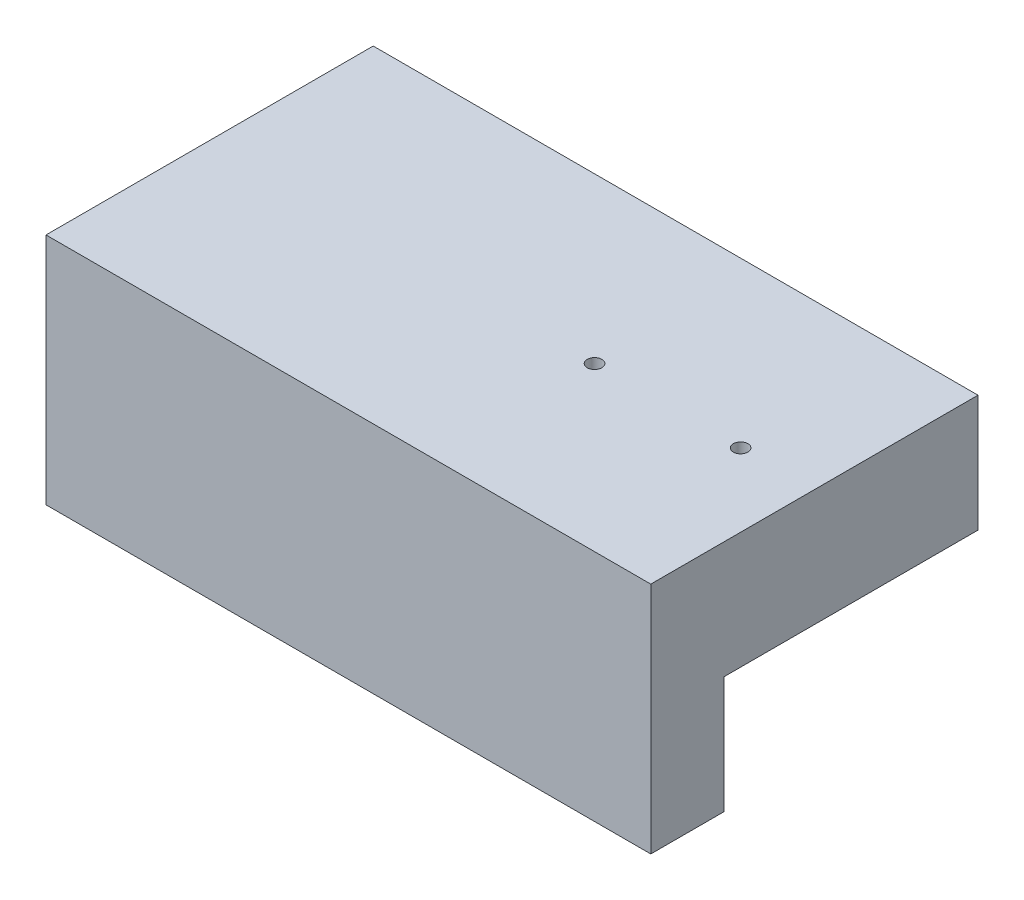
ISO-10303-21;
HEADER;
FILE_DESCRIPTION(('STEP AP214'),'2;1');
FILE_NAME('part.step','',(''),(''),'','','');
FILE_SCHEMA(('AUTOMOTIVE_DESIGN { 1 0 10303 214 1 1 1 1 }'));
ENDSEC;
DATA;
#1=APPLICATION_CONTEXT('core data for automotive mechanical design processes');
#2=APPLICATION_PROTOCOL_DEFINITION('international standard','automotive_design',2000,#1);
#3=PRODUCT_CONTEXT('',#1,'mechanical');
#4=PRODUCT('Part','Part','',(#3));
#5=PRODUCT_RELATED_PRODUCT_CATEGORY('part','',(#4));
#6=PRODUCT_DEFINITION_FORMATION('','',#4);
#7=PRODUCT_DEFINITION_CONTEXT('part definition',#1,'design');
#8=PRODUCT_DEFINITION('design','',#6,#7);
#9=PRODUCT_DEFINITION_SHAPE('','',#8);
#10=(LENGTH_UNIT() NAMED_UNIT(*) SI_UNIT(.MILLI.,.METRE.));
#11=(NAMED_UNIT(*) PLANE_ANGLE_UNIT() SI_UNIT($,.RADIAN.));
#12=(NAMED_UNIT(*) SI_UNIT($,.STERADIAN.) SOLID_ANGLE_UNIT());
#13=UNCERTAINTY_MEASURE_WITH_UNIT(LENGTH_MEASURE(1.E-05),#10,'distance_accuracy_value','');
#14=(GEOMETRIC_REPRESENTATION_CONTEXT(3) GLOBAL_UNCERTAINTY_ASSIGNED_CONTEXT((#13)) GLOBAL_UNIT_ASSIGNED_CONTEXT((#10,
#11,#12)) REPRESENTATION_CONTEXT('',''));
#15=CARTESIAN_POINT('',(0.,0.,0.));
#16=DIRECTION('',(0.,0.,1.));
#17=DIRECTION('',(1.,0.,0.));
#18=AXIS2_PLACEMENT_3D('',#15,#16,#17);
#19=CARTESIAN_POINT('',(15.0194734889558,31.6756509851629,19.7651463507343));
#20=DIRECTION('',(-1.,0.,0.));
#21=DIRECTION('',(0.,0.,1.));
#22=AXIS2_PLACEMENT_3D('',#19,#20,#21);
#23=PLANE('',#22);
#24=DIRECTION('',(0.,-1.,0.));
#25=VECTOR('',#24,1.);
#26=CARTESIAN_POINT('',(15.0194734889558,31.6756509851629,33.9891463507343));
#27=LINE('',#26,#25);
#28=CARTESIAN_POINT('',(15.0194734889558,31.6756509851629,33.9891463507343));
#29=VERTEX_POINT('',#28);
#30=CARTESIAN_POINT('',(15.0194734889558,21.5156509851629,33.9891463507343));
#31=VERTEX_POINT('',#30);
#32=EDGE_CURVE('E234',#29,#31,#27,.T.);
#33=ORIENTED_EDGE('',*,*,#32,.T.);
#34=DIRECTION('',(0.,0.,1.));
#35=VECTOR('',#34,1.);
#36=CARTESIAN_POINT('',(15.0194734889558,21.5156509851629,33.9891463507343));
#37=LINE('',#36,#35);
#38=CARTESIAN_POINT('',(15.0194734889558,21.5156509851629,30.8141463507343));
#39=VERTEX_POINT('',#38);
#40=EDGE_CURVE('E200',#39,#31,#37,.T.);
#41=ORIENTED_EDGE('',*,*,#40,.F.);
#42=DIRECTION('',(0.,1.,0.));
#43=VECTOR('',#42,1.);
#44=CARTESIAN_POINT('',(15.0194734889558,21.5156509851629,30.8141463507343));
#45=LINE('',#44,#43);
#46=CARTESIAN_POINT('',(15.0194734889558,26.5956509851629,30.8141463507343));
#47=VERTEX_POINT('',#46);
#48=EDGE_CURVE('E212',#39,#47,#45,.T.);
#49=ORIENTED_EDGE('',*,*,#48,.T.);
#50=DIRECTION('',(0.,0.,-1.));
#51=VECTOR('',#50,1.);
#52=CARTESIAN_POINT('',(15.0194734889558,26.5956509851629,19.7651463507343));
#53=LINE('',#52,#51);
#54=CARTESIAN_POINT('',(15.0194734889558,26.5956509851629,19.7651463507343));
#55=VERTEX_POINT('',#54);
#56=EDGE_CURVE('E223',#47,#55,#53,.T.);
#57=ORIENTED_EDGE('',*,*,#56,.T.);
#58=DIRECTION('',(0.,-1.,0.));
#59=VECTOR('',#58,1.);
#60=CARTESIAN_POINT('',(15.0194734889558,31.6756509851629,19.7651463507343));
#61=LINE('',#60,#59);
#62=CARTESIAN_POINT('',(15.0194734889558,31.6756509851629,19.7651463507343));
#63=VERTEX_POINT('',#62);
#64=EDGE_CURVE('E11',#63,#55,#61,.T.);
#65=ORIENTED_EDGE('',*,*,#64,.F.);
#66=DIRECTION('',(0.,0.,-1.));
#67=VECTOR('',#66,1.);
#68=CARTESIAN_POINT('',(15.0194734889558,31.6756509851629,19.7651463507343));
#69=LINE('',#68,#67);
#70=EDGE_CURVE('E224',#29,#63,#69,.T.);
#71=ORIENTED_EDGE('',*,*,#70,.F.);
#72=EDGE_LOOP('',(#33,#41,#49,#57,#65,#71));
#73=FACE_BOUND('',#72,.T.);
#74=ADVANCED_FACE('F33',(#73),#23,.F.);
#75=CARTESIAN_POINT('',(15.0194734889558,31.6756509851629,19.7651463507343));
#76=DIRECTION('',(0.,0.,1.));
#77=DIRECTION('',(0.,-1.,0.));
#78=AXIS2_PLACEMENT_3D('',#75,#76,#77);
#79=PLANE('',#78);
#80=DIRECTION('',(-1.,0.,0.));
#81=VECTOR('',#80,1.);
#82=CARTESIAN_POINT('',(15.0194734889558,26.5956509851629,19.7651463507343));
#83=LINE('',#82,#81);
#84=CARTESIAN_POINT('',(-11.2695265110442,26.5956509851629,19.7651463507343));
#85=VERTEX_POINT('',#84);
#86=EDGE_CURVE('E236',#55,#85,#83,.T.);
#87=ORIENTED_EDGE('',*,*,#86,.T.);
#88=DIRECTION('',(0.,-1.,0.));
#89=VECTOR('',#88,1.);
#90=CARTESIAN_POINT('',(-11.2695265110442,31.6756509851629,19.7651463507343));
#91=LINE('',#90,#89);
#92=CARTESIAN_POINT('',(-11.2695265110442,31.6756509851629,19.7651463507343));
#93=VERTEX_POINT('',#92);
#94=EDGE_CURVE('E40',#93,#85,#91,.T.);
#95=ORIENTED_EDGE('',*,*,#94,.F.);
#96=DIRECTION('',(-1.,0.,0.));
#97=VECTOR('',#96,1.);
#98=CARTESIAN_POINT('',(15.0194734889558,31.6756509851629,19.7651463507343));
#99=LINE('',#98,#97);
#100=EDGE_CURVE('E227',#63,#93,#99,.T.);
#101=ORIENTED_EDGE('',*,*,#100,.F.);
#102=ORIENTED_EDGE('',*,*,#64,.T.);
#103=EDGE_LOOP('',(#87,#95,#101,#102));
#104=FACE_BOUND('',#103,.T.);
#105=ADVANCED_FACE('F254',(#104),#79,.F.);
#106=CARTESIAN_POINT('',(-11.2695265110442,31.6756509851629,19.7651463507343));
#107=DIRECTION('',(1.,0.,0.));
#108=DIRECTION('',(0.,0.,-1.));
#109=AXIS2_PLACEMENT_3D('',#106,#107,#108);
#110=PLANE('',#109);
#111=DIRECTION('',(0.,0.,1.));
#112=VECTOR('',#111,1.);
#113=CARTESIAN_POINT('',(-11.2695265110442,26.5956509851629,19.7651463507343));
#114=LINE('',#113,#112);
#115=CARTESIAN_POINT('',(-11.2695265110442,26.5956509851629,30.8141463507343));
#116=VERTEX_POINT('',#115);
#117=EDGE_CURVE('E228',#85,#116,#114,.T.);
#118=ORIENTED_EDGE('',*,*,#117,.T.);
#119=DIRECTION('',(0.,1.,0.));
#120=VECTOR('',#119,1.);
#121=CARTESIAN_POINT('',(-11.2695265110442,21.5156509851629,30.8141463507343));
#122=LINE('',#121,#120);
#123=CARTESIAN_POINT('',(-11.2695265110442,21.5156509851629,30.8141463507343));
#124=VERTEX_POINT('',#123);
#125=EDGE_CURVE('E208',#124,#116,#122,.T.);
#126=ORIENTED_EDGE('',*,*,#125,.F.);
#127=DIRECTION('',(0.,0.,-1.));
#128=VECTOR('',#127,1.);
#129=CARTESIAN_POINT('',(-11.2695265110442,21.5156509851629,30.8141463507343));
#130=LINE('',#129,#128);
#131=CARTESIAN_POINT('',(-11.2695265110442,21.5156509851629,33.9891463507343));
#132=VERTEX_POINT('',#131);
#133=EDGE_CURVE('E206',#132,#124,#130,.T.);
#134=ORIENTED_EDGE('',*,*,#133,.F.);
#135=DIRECTION('',(0.,-1.,0.));
#136=VECTOR('',#135,1.);
#137=CARTESIAN_POINT('',(-11.2695265110442,31.6756509851629,33.9891463507343));
#138=LINE('',#137,#136);
#139=CARTESIAN_POINT('',(-11.2695265110442,31.6756509851629,33.9891463507343));
#140=VERTEX_POINT('',#139);
#141=EDGE_CURVE('E240',#140,#132,#138,.T.);
#142=ORIENTED_EDGE('',*,*,#141,.F.);
#143=DIRECTION('',(0.,0.,1.));
#144=VECTOR('',#143,1.);
#145=CARTESIAN_POINT('',(-11.2695265110442,31.6756509851629,19.7651463507343));
#146=LINE('',#145,#144);
#147=EDGE_CURVE('E230',#93,#140,#146,.T.);
#148=ORIENTED_EDGE('',*,*,#147,.F.);
#149=ORIENTED_EDGE('',*,*,#94,.T.);
#150=EDGE_LOOP('',(#118,#126,#134,#142,#148,#149));
#151=FACE_BOUND('',#150,.T.);
#152=ADVANCED_FACE('F245',(#151),#110,.F.);
#153=CARTESIAN_POINT('',(15.0194734889558,31.6756509851629,33.9891463507343));
#154=DIRECTION('',(0.,0.,-1.));
#155=DIRECTION('',(0.,1.,0.));
#156=AXIS2_PLACEMENT_3D('',#153,#154,#155);
#157=PLANE('',#156);
#158=ORIENTED_EDGE('',*,*,#141,.T.);
#159=DIRECTION('',(-1.,0.,0.));
#160=VECTOR('',#159,1.);
#161=CARTESIAN_POINT('',(-11.2695265110442,21.5156509851629,33.9891463507343));
#162=LINE('',#161,#160);
#163=EDGE_CURVE('E203',#31,#132,#162,.T.);
#164=ORIENTED_EDGE('',*,*,#163,.F.);
#165=ORIENTED_EDGE('',*,*,#32,.F.);
#166=DIRECTION('',(1.,0.,0.));
#167=VECTOR('',#166,1.);
#168=CARTESIAN_POINT('',(15.0194734889558,31.6756509851629,33.9891463507343));
#169=LINE('',#168,#167);
#170=EDGE_CURVE('E232',#140,#29,#169,.T.);
#171=ORIENTED_EDGE('',*,*,#170,.F.);
#172=EDGE_LOOP('',(#158,#164,#165,#171));
#173=FACE_BOUND('',#172,.T.);
#174=ADVANCED_FACE('F288',(#173),#157,.F.);
#175=CARTESIAN_POINT('',(0.,31.6756509851629,0.));
#176=DIRECTION('',(0.,-1.,0.));
#177=DIRECTION('',(0.,0.,-1.));
#178=AXIS2_PLACEMENT_3D('',#175,#176,#177);
#179=PLANE('',#178);
#180=CARTESIAN_POINT('',(11.8444734889558,31.6756509851629,26.9088963507343));
#181=DIRECTION('',(0.,1.,0.));
#182=DIRECTION('',(0.,0.,1.));
#183=AXIS2_PLACEMENT_3D('',#180,#181,#182);
#184=CIRCLE('',#183,0.3175);
#185=CARTESIAN_POINT('',(11.8444734889558,31.6756509851629,27.2263963507343));
#186=VERTEX_POINT('',#185);
#187=EDGE_CURVE('E471',#186,#186,#184,.T.);
#188=ORIENTED_EDGE('',*,*,#187,.F.);
#189=EDGE_LOOP('',(#188));
#190=FACE_BOUND('',#189,.T.);
#191=CARTESIAN_POINT('',(5.49447348895577,31.6756509851629,26.9088963507343));
#192=DIRECTION('',(0.,1.,0.));
#193=DIRECTION('',(0.,0.,1.));
#194=AXIS2_PLACEMENT_3D('',#191,#192,#193);
#195=CIRCLE('',#194,0.317500000000002);
#196=CARTESIAN_POINT('',(5.49447348895577,31.6756509851629,27.2263963507343));
#197=VERTEX_POINT('',#196);
#198=EDGE_CURVE('E180',#197,#197,#195,.T.);
#199=ORIENTED_EDGE('',*,*,#198,.F.);
#200=EDGE_LOOP('',(#199));
#201=FACE_BOUND('',#200,.T.);
#202=ORIENTED_EDGE('',*,*,#70,.T.);
#203=ORIENTED_EDGE('',*,*,#100,.T.);
#204=ORIENTED_EDGE('',*,*,#147,.T.);
#205=ORIENTED_EDGE('',*,*,#170,.T.);
#206=EDGE_LOOP('',(#202,#203,#204,#205));
#207=FACE_BOUND('',#206,.T.);
#208=ADVANCED_FACE('F290',(#190,#201,#207),#179,.F.);
#209=CARTESIAN_POINT('',(0.,26.5956509851629,0.));
#210=DIRECTION('',(0.,-1.,0.));
#211=DIRECTION('',(0.,0.,-1.));
#212=AXIS2_PLACEMENT_3D('',#209,#210,#211);
#213=PLANE('',#212);
#214=CARTESIAN_POINT('',(11.8444734889558,26.5956509851629,26.9088963507343));
#215=DIRECTION('',(0.,-1.,0.));
#216=DIRECTION('',(0.,0.,-1.));
#217=AXIS2_PLACEMENT_3D('',#214,#215,#216);
#218=CIRCLE('',#217,0.3175);
#219=CARTESIAN_POINT('',(11.8444734889558,26.5956509851629,26.5913963507343));
#220=VERTEX_POINT('',#219);
#221=EDGE_CURVE('E469',#220,#220,#218,.F.);
#222=ORIENTED_EDGE('',*,*,#221,.T.);
#223=EDGE_LOOP('',(#222));
#224=FACE_BOUND('',#223,.T.);
#225=CARTESIAN_POINT('',(5.49447348895577,26.5956509851629,26.9088963507343));
#226=DIRECTION('',(0.,-1.,0.));
#227=DIRECTION('',(0.,0.,-1.));
#228=AXIS2_PLACEMENT_3D('',#225,#226,#227);
#229=CIRCLE('',#228,0.317500000000002);
#230=CARTESIAN_POINT('',(5.49447348895577,26.5956509851629,26.5913963507343));
#231=VERTEX_POINT('',#230);
#232=EDGE_CURVE('E162',#231,#231,#229,.F.);
#233=ORIENTED_EDGE('',*,*,#232,.T.);
#234=EDGE_LOOP('',(#233));
#235=FACE_BOUND('',#234,.T.);
#236=DIRECTION('',(0.,0.,1.));
#237=VECTOR('',#236,1.);
#238=CARTESIAN_POINT('',(3.52597348895577,26.5956509851629,21.3526463507343));
#239=LINE('',#238,#237);
#240=CARTESIAN_POINT('',(3.52597348895577,26.5956509851629,21.3526463507343));
#241=VERTEX_POINT('',#240);
#242=CARTESIAN_POINT('',(3.52597348895577,26.5956509851629,30.8141463507343));
#243=VERTEX_POINT('',#242);
#244=EDGE_CURVE('E47',#241,#243,#239,.T.);
#245=ORIENTED_EDGE('',*,*,#244,.F.);
#246=DIRECTION('',(1.,0.,0.));
#247=VECTOR('',#246,1.);
#248=CARTESIAN_POINT('',(3.52597348895577,26.5956509851629,21.3526463507343));
#249=LINE('',#248,#247);
#250=CARTESIAN_POINT('',(-6.88802651104423,26.5956509851629,21.3526463507343));
#251=VERTEX_POINT('',#250);
#252=EDGE_CURVE('E159',#251,#241,#249,.T.);
#253=ORIENTED_EDGE('',*,*,#252,.F.);
#254=DIRECTION('',(0.,0.,-1.));
#255=VECTOR('',#254,1.);
#256=CARTESIAN_POINT('',(-6.88802651104423,26.5956509851629,21.3526463507343));
#257=LINE('',#256,#255);
#258=CARTESIAN_POINT('',(-6.88802651104423,26.5956509851629,30.8141463507343));
#259=VERTEX_POINT('',#258);
#260=EDGE_CURVE('E178',#259,#251,#257,.T.);
#261=ORIENTED_EDGE('',*,*,#260,.F.);
#262=DIRECTION('',(1.,0.,0.));
#263=VECTOR('',#262,1.);
#264=CARTESIAN_POINT('',(-4.22102651104423,26.5956509851629,30.8141463507343));
#265=LINE('',#264,#263);
#266=EDGE_CURVE('E55',#116,#259,#265,.T.);
#267=ORIENTED_EDGE('',*,*,#266,.F.);
#268=ORIENTED_EDGE('',*,*,#117,.F.);
#269=ORIENTED_EDGE('',*,*,#86,.F.);
#270=ORIENTED_EDGE('',*,*,#56,.F.);
#271=DIRECTION('',(1.,0.,0.));
#272=VECTOR('',#271,1.);
#273=CARTESIAN_POINT('',(15.0194734889558,26.5956509851629,30.8141463507343));
#274=LINE('',#273,#272);
#275=EDGE_CURVE('E192',#243,#47,#274,.T.);
#276=ORIENTED_EDGE('',*,*,#275,.F.);
#277=EDGE_LOOP('',(#245,#253,#261,#267,#268,#269,#270,#276));
#278=FACE_BOUND('',#277,.T.);
#279=ADVANCED_FACE('F250',(#224,#235,#278),#213,.T.);
#280=CARTESIAN_POINT('',(-4.22102651104423,21.5156509851629,30.8141463507343));
#281=DIRECTION('',(0.,0.,1.));
#282=DIRECTION('',(0.,-1.,0.));
#283=AXIS2_PLACEMENT_3D('',#280,#281,#282);
#284=PLANE('',#283);
#285=ORIENTED_EDGE('',*,*,#266,.T.);
#286=DIRECTION('',(0.,-1.,0.));
#287=VECTOR('',#286,1.);
#288=CARTESIAN_POINT('',(-6.88802651104423,30.0881509851629,30.8141463507343));
#289=LINE('',#288,#287);
#290=CARTESIAN_POINT('',(-6.88802651104423,30.0881509851629,30.8141463507343));
#291=VERTEX_POINT('',#290);
#292=EDGE_CURVE('E134',#291,#259,#289,.T.);
#293=ORIENTED_EDGE('',*,*,#292,.F.);
#294=DIRECTION('',(-1.,0.,0.));
#295=VECTOR('',#294,1.);
#296=CARTESIAN_POINT('',(-6.88802651104423,30.0881509851629,30.8141463507343));
#297=LINE('',#296,#295);
#298=CARTESIAN_POINT('',(-4.22102651104423,30.0881509851629,30.8141463507343));
#299=VERTEX_POINT('',#298);
#300=EDGE_CURVE('E139',#299,#291,#297,.T.);
#301=ORIENTED_EDGE('',*,*,#300,.F.);
#302=DIRECTION('',(0.,1.,0.));
#303=VECTOR('',#302,1.);
#304=CARTESIAN_POINT('',(-4.22102651104423,21.5156509851629,30.8141463507343));
#305=LINE('',#304,#303);
#306=CARTESIAN_POINT('',(-4.22102651104423,21.5156509851629,30.8141463507343));
#307=VERTEX_POINT('',#306);
#308=EDGE_CURVE('E221',#307,#299,#305,.T.);
#309=ORIENTED_EDGE('',*,*,#308,.F.);
#310=DIRECTION('',(1.,0.,0.));
#311=VECTOR('',#310,1.);
#312=CARTESIAN_POINT('',(-4.22102651104423,21.5156509851629,30.8141463507343));
#313=LINE('',#312,#311);
#314=EDGE_CURVE('E188',#124,#307,#313,.T.);
#315=ORIENTED_EDGE('',*,*,#314,.F.);
#316=ORIENTED_EDGE('',*,*,#125,.T.);
#317=EDGE_LOOP('',(#285,#293,#301,#309,#315,#316));
#318=FACE_BOUND('',#317,.T.);
#319=ADVANCED_FACE('F136',(#318),#284,.F.);
#320=CARTESIAN_POINT('',(-4.22102651104423,21.5156509851629,32.4016463507343));
#321=DIRECTION('',(-1.,0.,0.));
#322=DIRECTION('',(0.,0.,1.));
#323=AXIS2_PLACEMENT_3D('',#320,#321,#322);
#324=PLANE('',#323);
#325=ORIENTED_EDGE('',*,*,#308,.T.);
#326=DIRECTION('',(0.,0.,-1.));
#327=VECTOR('',#326,1.);
#328=CARTESIAN_POINT('',(-4.22102651104423,30.0881509851629,30.8141463507343));
#329=LINE('',#328,#327);
#330=CARTESIAN_POINT('',(-4.22102651104423,30.0881509851629,32.4016463507343));
#331=VERTEX_POINT('',#330);
#332=EDGE_CURVE('E145',#331,#299,#329,.T.);
#333=ORIENTED_EDGE('',*,*,#332,.F.);
#334=DIRECTION('',(0.,1.,0.));
#335=VECTOR('',#334,1.);
#336=CARTESIAN_POINT('',(-4.22102651104423,21.5156509851629,32.4016463507343));
#337=LINE('',#336,#335);
#338=CARTESIAN_POINT('',(-4.22102651104423,21.5156509851629,32.4016463507343));
#339=VERTEX_POINT('',#338);
#340=EDGE_CURVE('E219',#339,#331,#337,.T.);
#341=ORIENTED_EDGE('',*,*,#340,.F.);
#342=DIRECTION('',(0.,0.,1.));
#343=VECTOR('',#342,1.);
#344=CARTESIAN_POINT('',(-4.22102651104423,21.5156509851629,32.4016463507343));
#345=LINE('',#344,#343);
#346=EDGE_CURVE('E191',#307,#339,#345,.T.);
#347=ORIENTED_EDGE('',*,*,#346,.F.);
#348=EDGE_LOOP('',(#325,#333,#341,#347));
#349=FACE_BOUND('',#348,.T.);
#350=ADVANCED_FACE('F278',(#349),#324,.F.);
#351=CARTESIAN_POINT('',(0.858973488955771,21.5156509851629,32.4016463507343));
#352=DIRECTION('',(0.,0.,1.));
#353=DIRECTION('',(0.,-1.,0.));
#354=AXIS2_PLACEMENT_3D('',#351,#352,#353);
#355=PLANE('',#354);
#356=ORIENTED_EDGE('',*,*,#340,.T.);
#357=DIRECTION('',(-1.,0.,0.));
#358=VECTOR('',#357,1.);
#359=CARTESIAN_POINT('',(-4.22102651104423,30.0881509851629,32.4016463507343));
#360=LINE('',#359,#358);
#361=CARTESIAN_POINT('',(0.858973488955771,30.0881509851629,32.4016463507343));
#362=VERTEX_POINT('',#361);
#363=EDGE_CURVE('E175',#362,#331,#360,.T.);
#364=ORIENTED_EDGE('',*,*,#363,.F.);
#365=DIRECTION('',(0.,1.,0.));
#366=VECTOR('',#365,1.);
#367=CARTESIAN_POINT('',(0.858973488955771,21.5156509851629,32.4016463507343));
#368=LINE('',#367,#366);
#369=CARTESIAN_POINT('',(0.858973488955771,21.5156509851629,32.4016463507343));
#370=VERTEX_POINT('',#369);
#371=EDGE_CURVE('E217',#370,#362,#368,.T.);
#372=ORIENTED_EDGE('',*,*,#371,.F.);
#373=DIRECTION('',(1.,0.,0.));
#374=VECTOR('',#373,1.);
#375=CARTESIAN_POINT('',(0.858973488955771,21.5156509851629,32.4016463507343));
#376=LINE('',#375,#374);
#377=EDGE_CURVE('E194',#339,#370,#376,.T.);
#378=ORIENTED_EDGE('',*,*,#377,.F.);
#379=EDGE_LOOP('',(#356,#364,#372,#378));
#380=FACE_BOUND('',#379,.T.);
#381=ADVANCED_FACE('F344',(#380),#355,.F.);
#382=CARTESIAN_POINT('',(0.858973488955771,21.5156509851629,30.8141463507343));
#383=DIRECTION('',(1.,0.,0.));
#384=DIRECTION('',(0.,0.,-1.));
#385=AXIS2_PLACEMENT_3D('',#382,#383,#384);
#386=PLANE('',#385);
#387=ORIENTED_EDGE('',*,*,#371,.T.);
#388=DIRECTION('',(0.,0.,1.));
#389=VECTOR('',#388,1.);
#390=CARTESIAN_POINT('',(0.858973488955771,30.0881509851629,32.4016463507343));
#391=LINE('',#390,#389);
#392=CARTESIAN_POINT('',(0.858973488955771,30.0881509851629,30.8141463507343));
#393=VERTEX_POINT('',#392);
#394=EDGE_CURVE('E172',#393,#362,#391,.T.);
#395=ORIENTED_EDGE('',*,*,#394,.F.);
#396=DIRECTION('',(0.,1.,0.));
#397=VECTOR('',#396,1.);
#398=CARTESIAN_POINT('',(0.858973488955771,21.5156509851629,30.8141463507343));
#399=LINE('',#398,#397);
#400=CARTESIAN_POINT('',(0.858973488955771,21.5156509851629,30.8141463507343));
#401=VERTEX_POINT('',#400);
#402=EDGE_CURVE('E215',#401,#393,#399,.T.);
#403=ORIENTED_EDGE('',*,*,#402,.F.);
#404=DIRECTION('',(0.,0.,-1.));
#405=VECTOR('',#404,1.);
#406=CARTESIAN_POINT('',(0.858973488955771,21.5156509851629,30.8141463507343));
#407=LINE('',#406,#405);
#408=EDGE_CURVE('E196',#370,#401,#407,.T.);
#409=ORIENTED_EDGE('',*,*,#408,.F.);
#410=EDGE_LOOP('',(#387,#395,#403,#409));
#411=FACE_BOUND('',#410,.T.);
#412=ADVANCED_FACE('F272',(#411),#386,.F.);
#413=CARTESIAN_POINT('',(15.0194734889558,21.5156509851629,30.8141463507343));
#414=DIRECTION('',(0.,0.,1.));
#415=DIRECTION('',(1.,0.,0.));
#416=AXIS2_PLACEMENT_3D('',#413,#414,#415);
#417=PLANE('',#416);
#418=ORIENTED_EDGE('',*,*,#402,.T.);
#419=DIRECTION('',(-1.,0.,0.));
#420=VECTOR('',#419,1.);
#421=CARTESIAN_POINT('',(3.52597348895577,30.0881509851629,30.8141463507343));
#422=LINE('',#421,#420);
#423=CARTESIAN_POINT('',(3.52597348895577,30.0881509851629,30.8141463507343));
#424=VERTEX_POINT('',#423);
#425=EDGE_CURVE('E169',#424,#393,#422,.T.);
#426=ORIENTED_EDGE('',*,*,#425,.F.);
#427=DIRECTION('',(0.,-1.,0.));
#428=VECTOR('',#427,1.);
#429=CARTESIAN_POINT('',(3.52597348895577,30.0881509851629,30.8141463507343));
#430=LINE('',#429,#428);
#431=EDGE_CURVE('E183',#424,#243,#430,.T.);
#432=ORIENTED_EDGE('',*,*,#431,.T.);
#433=ORIENTED_EDGE('',*,*,#275,.T.);
#434=ORIENTED_EDGE('',*,*,#48,.F.);
#435=DIRECTION('',(1.,0.,0.));
#436=VECTOR('',#435,1.);
#437=CARTESIAN_POINT('',(15.0194734889558,21.5156509851629,30.8141463507343));
#438=LINE('',#437,#436);
#439=EDGE_CURVE('E198',#401,#39,#438,.T.);
#440=ORIENTED_EDGE('',*,*,#439,.F.);
#441=EDGE_LOOP('',(#418,#426,#432,#433,#434,#440));
#442=FACE_BOUND('',#441,.T.);
#443=ADVANCED_FACE('F261',(#442),#417,.F.);
#444=CARTESIAN_POINT('',(0.,21.5156509851629,0.));
#445=DIRECTION('',(0.,1.,0.));
#446=DIRECTION('',(0.,0.,1.));
#447=AXIS2_PLACEMENT_3D('',#444,#445,#446);
#448=PLANE('',#447);
#449=ORIENTED_EDGE('',*,*,#314,.T.);
#450=ORIENTED_EDGE('',*,*,#346,.T.);
#451=ORIENTED_EDGE('',*,*,#377,.T.);
#452=ORIENTED_EDGE('',*,*,#408,.T.);
#453=ORIENTED_EDGE('',*,*,#439,.T.);
#454=ORIENTED_EDGE('',*,*,#40,.T.);
#455=ORIENTED_EDGE('',*,*,#163,.T.);
#456=ORIENTED_EDGE('',*,*,#133,.T.);
#457=EDGE_LOOP('',(#449,#450,#451,#452,#453,#454,#455,#456));
#458=FACE_BOUND('',#457,.T.);
#459=ADVANCED_FACE('F282',(#458),#448,.F.);
#460=CARTESIAN_POINT('',(3.52597348895577,30.0881509851629,21.3526463507343));
#461=DIRECTION('',(1.,0.,0.));
#462=DIRECTION('',(0.,0.,-1.));
#463=AXIS2_PLACEMENT_3D('',#460,#461,#462);
#464=PLANE('',#463);
#465=ORIENTED_EDGE('',*,*,#244,.T.);
#466=ORIENTED_EDGE('',*,*,#431,.F.);
#467=DIRECTION('',(0.,0.,1.));
#468=VECTOR('',#467,1.);
#469=CARTESIAN_POINT('',(3.52597348895577,30.0881509851629,21.3526463507343));
#470=LINE('',#469,#468);
#471=CARTESIAN_POINT('',(3.52597348895577,30.0881509851629,21.3526463507343));
#472=VERTEX_POINT('',#471);
#473=EDGE_CURVE('E166',#472,#424,#470,.T.);
#474=ORIENTED_EDGE('',*,*,#473,.F.);
#475=DIRECTION('',(0.,-1.,0.));
#476=VECTOR('',#475,1.);
#477=CARTESIAN_POINT('',(3.52597348895577,30.0881509851629,21.3526463507343));
#478=LINE('',#477,#476);
#479=EDGE_CURVE('E185',#472,#241,#478,.T.);
#480=ORIENTED_EDGE('',*,*,#479,.T.);
#481=EDGE_LOOP('',(#465,#466,#474,#480));
#482=FACE_BOUND('',#481,.T.);
#483=ADVANCED_FACE('F267',(#482),#464,.F.);
#484=CARTESIAN_POINT('',(3.52597348895577,30.0881509851629,21.3526463507343));
#485=DIRECTION('',(0.,0.,-1.));
#486=DIRECTION('',(0.,1.,0.));
#487=AXIS2_PLACEMENT_3D('',#484,#485,#486);
#488=PLANE('',#487);
#489=ORIENTED_EDGE('',*,*,#252,.T.);
#490=ORIENTED_EDGE('',*,*,#479,.F.);
#491=DIRECTION('',(1.,0.,0.));
#492=VECTOR('',#491,1.);
#493=CARTESIAN_POINT('',(3.52597348895577,30.0881509851629,21.3526463507343));
#494=LINE('',#493,#492);
#495=CARTESIAN_POINT('',(-6.88802651104423,30.0881509851629,21.3526463507343));
#496=VERTEX_POINT('',#495);
#497=EDGE_CURVE('E153',#496,#472,#494,.T.);
#498=ORIENTED_EDGE('',*,*,#497,.F.);
#499=DIRECTION('',(0.,-1.,0.));
#500=VECTOR('',#499,1.);
#501=CARTESIAN_POINT('',(-6.88802651104423,30.0881509851629,21.3526463507343));
#502=LINE('',#501,#500);
#503=EDGE_CURVE('E144',#496,#251,#502,.T.);
#504=ORIENTED_EDGE('',*,*,#503,.T.);
#505=EDGE_LOOP('',(#489,#490,#498,#504));
#506=FACE_BOUND('',#505,.T.);
#507=ADVANCED_FACE('F265',(#506),#488,.F.);
#508=CARTESIAN_POINT('',(-6.88802651104423,30.0881509851629,21.3526463507343));
#509=DIRECTION('',(-1.,0.,0.));
#510=DIRECTION('',(0.,0.,1.));
#511=AXIS2_PLACEMENT_3D('',#508,#509,#510);
#512=PLANE('',#511);
#513=ORIENTED_EDGE('',*,*,#260,.T.);
#514=ORIENTED_EDGE('',*,*,#503,.F.);
#515=DIRECTION('',(0.,0.,-1.));
#516=VECTOR('',#515,1.);
#517=CARTESIAN_POINT('',(-6.88802651104423,30.0881509851629,21.3526463507343));
#518=LINE('',#517,#516);
#519=EDGE_CURVE('E148',#291,#496,#518,.T.);
#520=ORIENTED_EDGE('',*,*,#519,.F.);
#521=ORIENTED_EDGE('',*,*,#292,.T.);
#522=EDGE_LOOP('',(#513,#514,#520,#521));
#523=FACE_BOUND('',#522,.T.);
#524=ADVANCED_FACE('F149',(#523),#512,.F.);
#525=CARTESIAN_POINT('',(0.,30.0881509851629,0.));
#526=DIRECTION('',(0.,-1.,0.));
#527=DIRECTION('',(0.,0.,-1.));
#528=AXIS2_PLACEMENT_3D('',#525,#526,#527);
#529=PLANE('',#528);
#530=ORIENTED_EDGE('',*,*,#300,.T.);
#531=ORIENTED_EDGE('',*,*,#519,.T.);
#532=ORIENTED_EDGE('',*,*,#497,.T.);
#533=ORIENTED_EDGE('',*,*,#473,.T.);
#534=ORIENTED_EDGE('',*,*,#425,.T.);
#535=ORIENTED_EDGE('',*,*,#394,.T.);
#536=ORIENTED_EDGE('',*,*,#363,.T.);
#537=ORIENTED_EDGE('',*,*,#332,.T.);
#538=EDGE_LOOP('',(#530,#531,#532,#533,#534,#535,#536,#537));
#539=FACE_BOUND('',#538,.T.);
#540=ADVANCED_FACE('F155',(#539),#529,.T.);
#541=CARTESIAN_POINT('',(5.49447348895577,21.5146509851629,26.9088963507343));
#542=DIRECTION('',(0.,1.,0.));
#543=DIRECTION('',(0.,0.,1.));
#544=AXIS2_PLACEMENT_3D('',#541,#542,#543);
#545=CYLINDRICAL_SURFACE('',#544,0.317500000000002);
#546=ORIENTED_EDGE('',*,*,#232,.F.);
#547=EDGE_LOOP('',(#546));
#548=FACE_BOUND('',#547,.T.);
#549=ORIENTED_EDGE('',*,*,#198,.T.);
#550=EDGE_LOOP('',(#549));
#551=FACE_BOUND('',#550,.T.);
#552=ADVANCED_FACE('F391',(#548,#551),#545,.F.);
#553=CARTESIAN_POINT('',(11.8444734889558,21.5146509851629,26.9088963507343));
#554=DIRECTION('',(0.,1.,0.));
#555=DIRECTION('',(0.,0.,1.));
#556=AXIS2_PLACEMENT_3D('',#553,#554,#555);
#557=CYLINDRICAL_SURFACE('',#556,0.3175);
#558=ORIENTED_EDGE('',*,*,#221,.F.);
#559=EDGE_LOOP('',(#558));
#560=FACE_BOUND('',#559,.T.);
#561=ORIENTED_EDGE('',*,*,#187,.T.);
#562=EDGE_LOOP('',(#561));
#563=FACE_BOUND('',#562,.T.);
#564=ADVANCED_FACE('F397',(#560,#563),#557,.F.);
#565=CLOSED_SHELL('',(#74,#105,#152,#174,#208,#279,#319,#350,#381,#412,#443,#459,#483,#507,#524,
#540,#552,#564));
#566=MANIFOLD_SOLID_BREP('B2',#565);
#567=ADVANCED_BREP_SHAPE_REPRESENTATION('',(#18,#566),#14);
#568=SHAPE_DEFINITION_REPRESENTATION(#9,#567);
ENDSEC;
END-ISO-10303-21;
